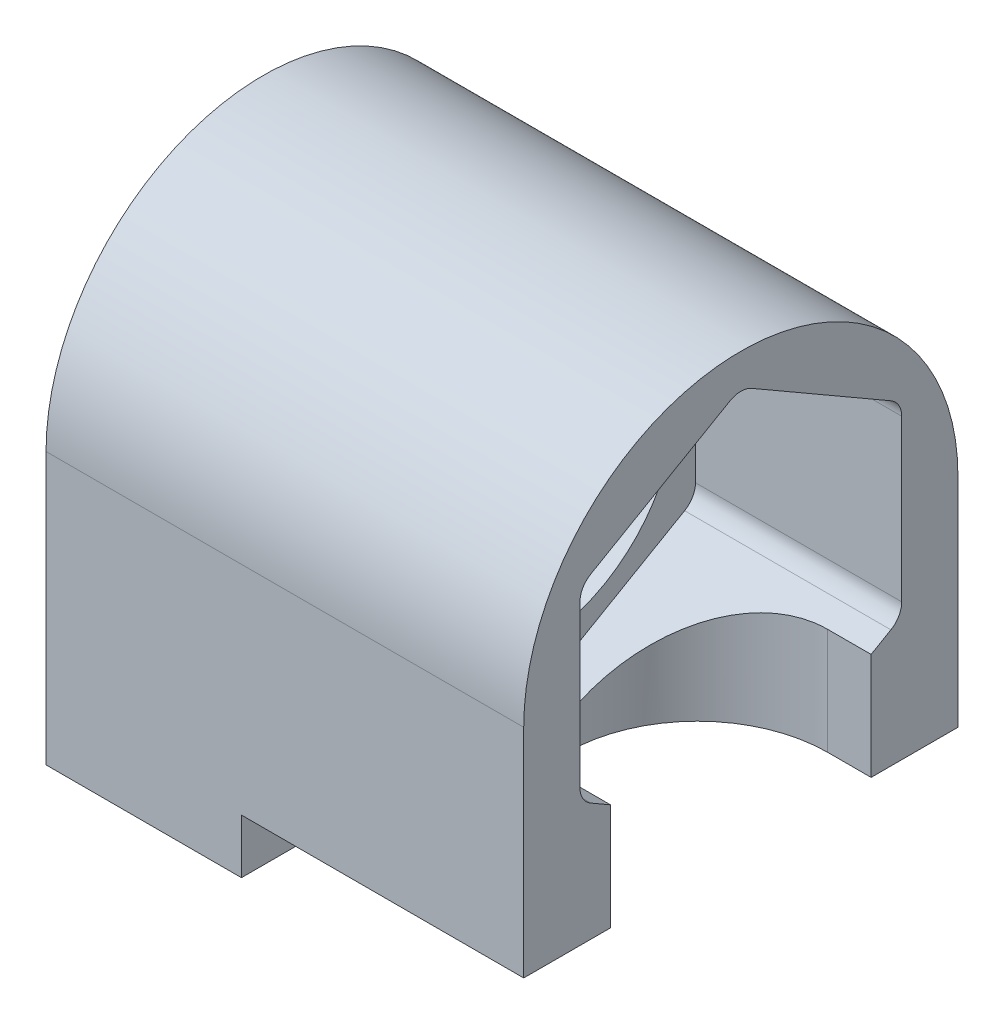
ISO-10303-21;
HEADER;
FILE_DESCRIPTION(('STEP AP214'),'2;1');
FILE_NAME('part.step','',(''),(''),'','','');
FILE_SCHEMA(('AUTOMOTIVE_DESIGN { 1 0 10303 214 1 1 1 1 }'));
ENDSEC;
DATA;
#1=APPLICATION_CONTEXT('core data for automotive mechanical design processes');
#2=APPLICATION_PROTOCOL_DEFINITION('international standard','automotive_design',2000,#1);
#3=PRODUCT_CONTEXT('',#1,'mechanical');
#4=PRODUCT('Part','Part','',(#3));
#5=PRODUCT_RELATED_PRODUCT_CATEGORY('part','',(#4));
#6=PRODUCT_DEFINITION_FORMATION('','',#4);
#7=PRODUCT_DEFINITION_CONTEXT('part definition',#1,'design');
#8=PRODUCT_DEFINITION('design','',#6,#7);
#9=PRODUCT_DEFINITION_SHAPE('','',#8);
#10=(LENGTH_UNIT() NAMED_UNIT(*) SI_UNIT(.MILLI.,.METRE.));
#11=(NAMED_UNIT(*) PLANE_ANGLE_UNIT() SI_UNIT($,.RADIAN.));
#12=(NAMED_UNIT(*) SI_UNIT($,.STERADIAN.) SOLID_ANGLE_UNIT());
#13=UNCERTAINTY_MEASURE_WITH_UNIT(LENGTH_MEASURE(1.E-05),#10,'distance_accuracy_value','');
#14=(GEOMETRIC_REPRESENTATION_CONTEXT(3) GLOBAL_UNCERTAINTY_ASSIGNED_CONTEXT((#13)) GLOBAL_UNIT_ASSIGNED_CONTEXT((#10,
#11,#12)) REPRESENTATION_CONTEXT('',''));
#15=CARTESIAN_POINT('',(0.,0.,0.));
#16=DIRECTION('',(0.,0.,1.));
#17=DIRECTION('',(1.,0.,0.));
#18=AXIS2_PLACEMENT_3D('',#15,#16,#17);
#19=CARTESIAN_POINT('',(22.,0.,0.));
#20=DIRECTION('',(-1.,0.,0.));
#21=DIRECTION('',(0.,0.,1.));
#22=AXIS2_PLACEMENT_3D('',#19,#20,#21);
#23=PLANE('',#22);
#24=DIRECTION('',(0.,0.,1.));
#25=VECTOR('',#24,1.);
#26=CARTESIAN_POINT('',(22.,-10.,10.));
#27=LINE('',#26,#25);
#28=CARTESIAN_POINT('',(22.,-10.,-10.));
#29=VERTEX_POINT('',#28);
#30=CARTESIAN_POINT('',(22.,-10.,-6.));
#31=VERTEX_POINT('',#30);
#32=EDGE_CURVE('E207',#29,#31,#27,.T.);
#33=ORIENTED_EDGE('',*,*,#32,.F.);
#34=DIRECTION('',(0.,1.,0.));
#35=VECTOR('',#34,1.);
#36=CARTESIAN_POINT('',(22.,-12.5,-10.));
#37=LINE('',#36,#35);
#38=CARTESIAN_POINT('',(22.,0.,-10.));
#39=VERTEX_POINT('',#38);
#40=EDGE_CURVE('E204',#29,#39,#37,.T.);
#41=ORIENTED_EDGE('',*,*,#40,.T.);
#42=CARTESIAN_POINT('',(22.,0.,0.));
#43=DIRECTION('',(1.,0.,0.));
#44=DIRECTION('',(0.,0.,1.));
#45=AXIS2_PLACEMENT_3D('',#42,#43,#44);
#46=CIRCLE('',#45,10.);
#47=CARTESIAN_POINT('',(22.,0.,10.));
#48=VERTEX_POINT('',#47);
#49=EDGE_CURVE('E334',#39,#48,#46,.T.);
#50=ORIENTED_EDGE('',*,*,#49,.T.);
#51=DIRECTION('',(0.,-1.,0.));
#52=VECTOR('',#51,1.);
#53=CARTESIAN_POINT('',(22.,0.,10.));
#54=LINE('',#53,#52);
#55=CARTESIAN_POINT('',(22.,-10.,10.));
#56=VERTEX_POINT('',#55);
#57=EDGE_CURVE('E337',#48,#56,#54,.T.);
#58=ORIENTED_EDGE('',*,*,#57,.T.);
#59=CARTESIAN_POINT('',(22.,-10.,6.));
#60=VERTEX_POINT('',#59);
#61=EDGE_CURVE('E205',#60,#56,#27,.T.);
#62=ORIENTED_EDGE('',*,*,#61,.F.);
#63=DIRECTION('',(0.,-1.,0.));
#64=VECTOR('',#63,1.);
#65=CARTESIAN_POINT('',(22.,10.001,6.));
#66=LINE('',#65,#64);
#67=CARTESIAN_POINT('',(22.,-5.09296595124119,6.));
#68=VERTEX_POINT('',#67);
#69=EDGE_CURVE('E367',#68,#60,#66,.T.);
#70=ORIENTED_EDGE('',*,*,#69,.F.);
#71=DIRECTION('',(0.,-0.5,-0.866025403784439));
#72=VECTOR('',#71,1.);
#73=CARTESIAN_POINT('',(22.,-4.56720891778429,6.91063789438405));
#74=LINE('',#73,#72);
#75=CARTESIAN_POINT('',(22.,-4.56720891778429,6.91063789438405));
#76=VERTEX_POINT('',#75);
#77=EDGE_CURVE('E417',#76,#68,#74,.T.);
#78=ORIENTED_EDGE('',*,*,#77,.F.);
#79=CARTESIAN_POINT('',(22.,-3.70118351399985,6.41063789438405));
#80=DIRECTION('',(1.,0.,0.));
#81=DIRECTION('',(0.,0.,-1.));
#82=AXIS2_PLACEMENT_3D('',#79,#80,#81);
#83=CIRCLE('',#82,1.);
#84=CARTESIAN_POINT('',(22.,-3.70118351399984,7.41063789438405));
#85=VERTEX_POINT('',#84);
#86=EDGE_CURVE('E375',#85,#76,#83,.T.);
#87=ORIENTED_EDGE('',*,*,#86,.F.);
#88=DIRECTION('',(0.,-1.,0.));
#89=VECTOR('',#88,1.);
#90=CARTESIAN_POINT('',(22.,3.70118351399985,7.41063789438405));
#91=LINE('',#90,#89);
#92=CARTESIAN_POINT('',(22.,3.70118351399985,7.41063789438405));
#93=VERTEX_POINT('',#92);
#94=EDGE_CURVE('E307',#93,#85,#91,.T.);
#95=ORIENTED_EDGE('',*,*,#94,.F.);
#96=CARTESIAN_POINT('',(22.,3.70118351399985,6.41063789438405));
#97=DIRECTION('',(1.,0.,0.));
#98=DIRECTION('',(0.,0.,-1.));
#99=AXIS2_PLACEMENT_3D('',#96,#97,#98);
#100=CIRCLE('',#99,1.);
#101=CARTESIAN_POINT('',(22.,4.56720891778429,6.91063789438405));
#102=VERTEX_POINT('',#101);
#103=EDGE_CURVE('E439',#102,#93,#100,.T.);
#104=ORIENTED_EDGE('',*,*,#103,.F.);
#105=DIRECTION('',(0.,-0.5,0.866025403784439));
#106=VECTOR('',#105,1.);
#107=CARTESIAN_POINT('',(22.,8.26839243178414,0.500000000000005));
#108=LINE('',#107,#106);
#109=CARTESIAN_POINT('',(22.,8.26839243178414,0.500000000000005));
#110=VERTEX_POINT('',#109);
#111=EDGE_CURVE('E437',#110,#102,#108,.T.);
#112=ORIENTED_EDGE('',*,*,#111,.F.);
#113=CARTESIAN_POINT('',(22.,7.4023670279997,0.));
#114=DIRECTION('',(1.,0.,0.));
#115=DIRECTION('',(0.,0.,-1.));
#116=AXIS2_PLACEMENT_3D('',#113,#114,#115);
#117=CIRCLE('',#116,1.);
#118=CARTESIAN_POINT('',(22.,8.26839243178414,-0.500000000000003));
#119=VERTEX_POINT('',#118);
#120=EDGE_CURVE('E434',#119,#110,#117,.T.);
#121=ORIENTED_EDGE('',*,*,#120,.F.);
#122=DIRECTION('',(0.,0.5,0.866025403784439));
#123=VECTOR('',#122,1.);
#124=CARTESIAN_POINT('',(22.,4.56720891778429,-6.91063789438405));
#125=LINE('',#124,#123);
#126=CARTESIAN_POINT('',(22.,4.56720891778429,-6.91063789438405));
#127=VERTEX_POINT('',#126);
#128=EDGE_CURVE('E431',#127,#119,#125,.T.);
#129=ORIENTED_EDGE('',*,*,#128,.F.);
#130=CARTESIAN_POINT('',(22.,3.70118351399985,-6.41063789438405));
#131=DIRECTION('',(1.,0.,0.));
#132=DIRECTION('',(0.,0.,-1.));
#133=AXIS2_PLACEMENT_3D('',#130,#131,#132);
#134=CIRCLE('',#133,1.);
#135=CARTESIAN_POINT('',(22.,3.70118351399985,-7.41063789438405));
#136=VERTEX_POINT('',#135);
#137=EDGE_CURVE('E428',#136,#127,#134,.T.);
#138=ORIENTED_EDGE('',*,*,#137,.F.);
#139=DIRECTION('',(0.,1.,0.));
#140=VECTOR('',#139,1.);
#141=CARTESIAN_POINT('',(22.,-3.70118351399985,-7.41063789438405));
#142=LINE('',#141,#140);
#143=CARTESIAN_POINT('',(22.,-3.70118351399985,-7.41063789438405));
#144=VERTEX_POINT('',#143);
#145=EDGE_CURVE('E425',#144,#136,#142,.T.);
#146=ORIENTED_EDGE('',*,*,#145,.F.);
#147=CARTESIAN_POINT('',(22.,-3.70118351399985,-6.41063789438405));
#148=DIRECTION('',(1.,0.,0.));
#149=DIRECTION('',(0.,0.,1.));
#150=AXIS2_PLACEMENT_3D('',#147,#148,#149);
#151=CIRCLE('',#150,1.);
#152=CARTESIAN_POINT('',(22.,-4.56720891778429,-6.91063789438405));
#153=VERTEX_POINT('',#152);
#154=EDGE_CURVE('E422',#153,#144,#151,.T.);
#155=ORIENTED_EDGE('',*,*,#154,.F.);
#156=DIRECTION('',(0.,0.5,-0.866025403784438));
#157=VECTOR('',#156,1.);
#158=CARTESIAN_POINT('',(22.,-8.26839243178414,-0.500000000000009));
#159=LINE('',#158,#157);
#160=CARTESIAN_POINT('',(22.,-5.09296595124119,-6.));
#161=VERTEX_POINT('',#160);
#162=EDGE_CURVE('E420',#161,#153,#159,.T.);
#163=ORIENTED_EDGE('',*,*,#162,.F.);
#164=DIRECTION('',(0.,-1.,0.));
#165=VECTOR('',#164,1.);
#166=CARTESIAN_POINT('',(22.,10.001,-6.));
#167=LINE('',#166,#165);
#168=EDGE_CURVE('E229',#161,#31,#167,.T.);
#169=ORIENTED_EDGE('',*,*,#168,.T.);
#170=EDGE_LOOP('',(#33,#41,#50,#58,#62,#70,#78,#87,#95,#104,#112,#121,#129,#138,#146,#155,#163,#169));
#171=FACE_BOUND('',#170,.T.);
#172=ADVANCED_FACE('F34',(#171),#23,.F.);
#173=CARTESIAN_POINT('',(22.,10.001,-6.));
#174=DIRECTION('',(0.,0.,-1.));
#175=DIRECTION('',(-1.,0.,0.));
#176=AXIS2_PLACEMENT_3D('',#173,#174,#175);
#177=PLANE('',#176);
#178=DIRECTION('',(-1.,0.,0.));
#179=VECTOR('',#178,1.);
#180=CARTESIAN_POINT('',(22.,-10.,-6.));
#181=LINE('',#180,#179);
#182=CARTESIAN_POINT('',(20.,-9.99999999999999,-6.));
#183=VERTEX_POINT('',#182);
#184=EDGE_CURVE('E48',#31,#183,#181,.T.);
#185=ORIENTED_EDGE('',*,*,#184,.F.);
#186=ORIENTED_EDGE('',*,*,#168,.F.);
#187=DIRECTION('',(-1.,0.,0.));
#188=VECTOR('',#187,1.);
#189=CARTESIAN_POINT('',(22.,-5.09296595124119,-6.));
#190=LINE('',#189,#188);
#191=CARTESIAN_POINT('',(20.,-5.09296595124119,-6.));
#192=VERTEX_POINT('',#191);
#193=EDGE_CURVE('E217',#161,#192,#190,.T.);
#194=ORIENTED_EDGE('',*,*,#193,.T.);
#195=DIRECTION('',(0.,-1.,0.));
#196=VECTOR('',#195,1.);
#197=CARTESIAN_POINT('',(20.,10.001,-6.));
#198=LINE('',#197,#196);
#199=EDGE_CURVE('E358',#192,#183,#198,.T.);
#200=ORIENTED_EDGE('',*,*,#199,.T.);
#201=EDGE_LOOP('',(#185,#186,#194,#200));
#202=FACE_BOUND('',#201,.T.);
#203=ADVANCED_FACE('F247',(#202),#177,.F.);
#204=CARTESIAN_POINT('',(20.,10.001,6.));
#205=DIRECTION('',(0.,0.,1.));
#206=DIRECTION('',(1.,0.,0.));
#207=AXIS2_PLACEMENT_3D('',#204,#205,#206);
#208=PLANE('',#207);
#209=DIRECTION('',(1.,0.,0.));
#210=VECTOR('',#209,1.);
#211=CARTESIAN_POINT('',(20.,-10.,6.));
#212=LINE('',#211,#210);
#213=CARTESIAN_POINT('',(20.,-10.,6.));
#214=VERTEX_POINT('',#213);
#215=EDGE_CURVE('E212',#214,#60,#212,.T.);
#216=ORIENTED_EDGE('',*,*,#215,.F.);
#217=DIRECTION('',(0.,-1.,0.));
#218=VECTOR('',#217,1.);
#219=CARTESIAN_POINT('',(20.,10.001,6.));
#220=LINE('',#219,#218);
#221=CARTESIAN_POINT('',(20.,-5.09296595124119,6.));
#222=VERTEX_POINT('',#221);
#223=EDGE_CURVE('E361',#222,#214,#220,.T.);
#224=ORIENTED_EDGE('',*,*,#223,.F.);
#225=DIRECTION('',(1.,0.,0.));
#226=VECTOR('',#225,1.);
#227=CARTESIAN_POINT('',(20.,-5.09296595124119,6.));
#228=LINE('',#227,#226);
#229=EDGE_CURVE('E221',#222,#68,#228,.T.);
#230=ORIENTED_EDGE('',*,*,#229,.T.);
#231=ORIENTED_EDGE('',*,*,#69,.T.);
#232=EDGE_LOOP('',(#216,#224,#230,#231));
#233=FACE_BOUND('',#232,.T.);
#234=ADVANCED_FACE('F253',(#233),#208,.F.);
#235=CARTESIAN_POINT('',(20.,10.001,0.));
#236=DIRECTION('',(0.,-1.,0.));
#237=DIRECTION('',(0.,0.,-1.));
#238=AXIS2_PLACEMENT_3D('',#235,#236,#237);
#239=CYLINDRICAL_SURFACE('',#238,6.);
#240=CARTESIAN_POINT('',(20.,-10.,0.));
#241=DIRECTION('',(0.,-1.,0.));
#242=DIRECTION('',(0.,0.,-1.));
#243=AXIS2_PLACEMENT_3D('',#240,#241,#242);
#244=CIRCLE('',#243,6.);
#245=EDGE_CURVE('E11',#183,#214,#244,.F.);
#246=ORIENTED_EDGE('',*,*,#245,.F.);
#247=ORIENTED_EDGE('',*,*,#199,.F.);
#248=CARTESIAN_POINT('',(20.,-8.55706756637895,0.));
#249=DIRECTION('',(0.,-0.866025403784439,-0.5));
#250=DIRECTION('',(0.,-0.5,0.866025403784439));
#251=AXIS2_PLACEMENT_3D('',#248,#249,#250);
#252=ELLIPSE('',#251,6.92820323027551,6.);
#253=CARTESIAN_POINT('',(14.0208696284493,-8.26839243178414,-0.500000000000009));
#254=VERTEX_POINT('',#253);
#255=EDGE_CURVE('E220',#192,#254,#252,.F.);
#256=ORIENTED_EDGE('',*,*,#255,.T.);
#257=CARTESIAN_POINT('',(14.0208696284493,-8.26839243178414,-0.500000000000009));
#258=CARTESIAN_POINT('',(14.0188521825808,-8.28231718289016,-0.475880957474097));
#259=CARTESIAN_POINT('',(14.0169346969243,-8.29523149292469,-0.451184964933938));
#260=CARTESIAN_POINT('',(14.0133475272348,-8.31896204949919,-0.400787080981888));
#261=CARTESIAN_POINT('',(14.0116778473985,-8.32977826050909,-0.375085172544272));
#262=CARTESIAN_POINT('',(14.0071179952394,-8.35892779500484,-0.296789237392052));
#263=CARTESIAN_POINT('',(14.0046692970077,-8.37401340765047,-0.242915856640522));
#264=CARTESIAN_POINT('',(14.0012312142338,-8.39500742661461,-0.133351947150136));
#265=CARTESIAN_POINT('',(14.0002428411104,-8.40090947256024,-0.0776601862650767));
#266=CARTESIAN_POINT('',(13.9998367320083,-8.40334708936088,0.0339595343816274));
#267=CARTESIAN_POINT('',(14.0004194455048,-8.39987997977511,0.0898875571657821));
#268=CARTESIAN_POINT('',(14.0030839236658,-8.38372532768659,0.200058324917833));
#269=CARTESIAN_POINT('',(14.0051581549396,-8.3710841189644,0.254308115693947));
#270=CARTESIAN_POINT('',(14.0105671904883,-8.33702562225325,0.359826263977945));
#271=CARTESIAN_POINT('',(14.0138994586155,-8.31562598362689,0.411100381958611));
#272=CARTESIAN_POINT('',(14.0187065810832,-8.28322783966206,0.473620291295192));
#273=CARTESIAN_POINT('',(14.0197734991748,-8.27595776424847,0.4869005967692));
#274=CARTESIAN_POINT('',(14.0208696284493,-8.26839243178414,0.5));
#275=B_SPLINE_CURVE_WITH_KNOTS('',3,(#257,#258,#259,#260,#261,#262,#263,#264,#265,#266,#267,
#268,#269,#270,#271,#272,#273,#274),.UNSPECIFIED.,.F.,.F.,(4,2,2,2,2,2,2,2,4),(0.,
0.0837190005730716,0.167439418753399,0.334574610497153,0.50182550562267,0.669124254962629,
0.835583890612964,1.00170972744011,1.04722485743825),.UNSPECIFIED.);
#276=CARTESIAN_POINT('',(14.0208696284493,-8.26839243178414,0.5));
#277=VERTEX_POINT('',#276);
#278=EDGE_CURVE('E56',#254,#277,#275,.T.);
#279=ORIENTED_EDGE('',*,*,#278,.T.);
#280=CARTESIAN_POINT('',(20.,-8.55706756637895,0.));
#281=DIRECTION('',(0.,-0.866025403784439,0.5));
#282=DIRECTION('',(0.,-0.5,-0.866025403784439));
#283=AXIS2_PLACEMENT_3D('',#280,#281,#282);
#284=ELLIPSE('',#283,6.92820323027551,6.);
#285=EDGE_CURVE('E216',#277,#222,#284,.F.);
#286=ORIENTED_EDGE('',*,*,#285,.T.);
#287=ORIENTED_EDGE('',*,*,#223,.T.);
#288=EDGE_LOOP('',(#246,#247,#256,#279,#286,#287));
#289=FACE_BOUND('',#288,.T.);
#290=ADVANCED_FACE('F231',(#289),#239,.F.);
#291=CARTESIAN_POINT('',(22.,0.,0.));
#292=DIRECTION('',(-1.,0.,0.));
#293=DIRECTION('',(0.,0.,1.));
#294=AXIS2_PLACEMENT_3D('',#291,#292,#293);
#295=CYLINDRICAL_SURFACE('',#294,6.5);
#296=CARTESIAN_POINT('',(0.,0.,0.));
#297=DIRECTION('',(1.,0.,0.));
#298=DIRECTION('',(0.,0.,-1.));
#299=AXIS2_PLACEMENT_3D('',#296,#297,#298);
#300=CIRCLE('',#299,6.5);
#301=CARTESIAN_POINT('',(0.,0.,-6.5));
#302=VERTEX_POINT('',#301);
#303=EDGE_CURVE('E292',#302,#302,#300,.T.);
#304=ORIENTED_EDGE('',*,*,#303,.F.);
#305=EDGE_LOOP('',(#304));
#306=FACE_BOUND('',#305,.T.);
#307=CARTESIAN_POINT('',(12.5,0.,0.));
#308=DIRECTION('',(1.,0.,0.));
#309=DIRECTION('',(0.,0.,-1.));
#310=AXIS2_PLACEMENT_3D('',#307,#308,#309);
#311=CIRCLE('',#310,6.5);
#312=CARTESIAN_POINT('',(12.5,0.,-6.5));
#313=VERTEX_POINT('',#312);
#314=EDGE_CURVE('E290',#313,#313,#311,.T.);
#315=ORIENTED_EDGE('',*,*,#314,.T.);
#316=EDGE_LOOP('',(#315));
#317=FACE_BOUND('',#316,.T.);
#318=ADVANCED_FACE('F258',(#306,#317),#295,.F.);
#319=CARTESIAN_POINT('',(0.,0.,0.));
#320=DIRECTION('',(-1.,0.,0.));
#321=DIRECTION('',(0.,0.,1.));
#322=AXIS2_PLACEMENT_3D('',#319,#320,#321);
#323=PLANE('',#322);
#324=CARTESIAN_POINT('',(0.,0.,0.));
#325=DIRECTION('',(1.,0.,0.));
#326=DIRECTION('',(0.,0.,1.));
#327=AXIS2_PLACEMENT_3D('',#324,#325,#326);
#328=CIRCLE('',#327,10.);
#329=CARTESIAN_POINT('',(0.,0.,-10.));
#330=VERTEX_POINT('',#329);
#331=CARTESIAN_POINT('',(0.,0.,10.));
#332=VERTEX_POINT('',#331);
#333=EDGE_CURVE('E297',#330,#332,#328,.T.);
#334=ORIENTED_EDGE('',*,*,#333,.F.);
#335=DIRECTION('',(0.,1.,0.));
#336=VECTOR('',#335,1.);
#337=CARTESIAN_POINT('',(0.,-12.5,-10.));
#338=LINE('',#337,#336);
#339=CARTESIAN_POINT('',(0.,-12.5,-10.));
#340=VERTEX_POINT('',#339);
#341=EDGE_CURVE('E338',#340,#330,#338,.T.);
#342=ORIENTED_EDGE('',*,*,#341,.F.);
#343=DIRECTION('',(0.,0.,-1.));
#344=VECTOR('',#343,1.);
#345=CARTESIAN_POINT('',(0.,-12.5,10.));
#346=LINE('',#345,#344);
#347=CARTESIAN_POINT('',(0.,-12.5,10.));
#348=VERTEX_POINT('',#347);
#349=EDGE_CURVE('E345',#348,#340,#346,.T.);
#350=ORIENTED_EDGE('',*,*,#349,.F.);
#351=DIRECTION('',(0.,-1.,0.));
#352=VECTOR('',#351,1.);
#353=CARTESIAN_POINT('',(0.,0.,10.));
#354=LINE('',#353,#352);
#355=EDGE_CURVE('E281',#332,#348,#354,.T.);
#356=ORIENTED_EDGE('',*,*,#355,.F.);
#357=EDGE_LOOP('',(#334,#342,#350,#356));
#358=FACE_BOUND('',#357,.T.);
#359=ORIENTED_EDGE('',*,*,#303,.T.);
#360=EDGE_LOOP('',(#359));
#361=FACE_BOUND('',#360,.T.);
#362=ADVANCED_FACE('F260',(#358,#361),#323,.T.);
#363=CARTESIAN_POINT('',(22.,0.,0.));
#364=DIRECTION('',(-1.,0.,0.));
#365=DIRECTION('',(0.,0.,1.));
#366=AXIS2_PLACEMENT_3D('',#363,#364,#365);
#367=CYLINDRICAL_SURFACE('',#366,10.);
#368=ORIENTED_EDGE('',*,*,#333,.T.);
#369=DIRECTION('',(-1.,0.,0.));
#370=VECTOR('',#369,1.);
#371=CARTESIAN_POINT('',(22.,0.,10.));
#372=LINE('',#371,#370);
#373=EDGE_CURVE('E42',#48,#332,#372,.T.);
#374=ORIENTED_EDGE('',*,*,#373,.F.);
#375=ORIENTED_EDGE('',*,*,#49,.F.);
#376=DIRECTION('',(-1.,0.,0.));
#377=VECTOR('',#376,1.);
#378=CARTESIAN_POINT('',(22.,0.,-10.));
#379=LINE('',#378,#377);
#380=EDGE_CURVE('E287',#39,#330,#379,.T.);
#381=ORIENTED_EDGE('',*,*,#380,.T.);
#382=EDGE_LOOP('',(#368,#374,#375,#381));
#383=FACE_BOUND('',#382,.T.);
#384=ADVANCED_FACE('F36',(#383),#367,.T.);
#385=CARTESIAN_POINT('',(22.,0.,10.));
#386=DIRECTION('',(0.,0.,-1.));
#387=DIRECTION('',(0.,1.,0.));
#388=AXIS2_PLACEMENT_3D('',#385,#386,#387);
#389=PLANE('',#388);
#390=DIRECTION('',(-1.,0.,0.));
#391=VECTOR('',#390,1.);
#392=CARTESIAN_POINT('',(22.,-12.5,10.));
#393=LINE('',#392,#391);
#394=CARTESIAN_POINT('',(9.,-12.5,10.));
#395=VERTEX_POINT('',#394);
#396=EDGE_CURVE('E279',#395,#348,#393,.T.);
#397=ORIENTED_EDGE('',*,*,#396,.F.);
#398=DIRECTION('',(0.,-1.,0.));
#399=VECTOR('',#398,1.);
#400=CARTESIAN_POINT('',(9.,-10.,10.));
#401=LINE('',#400,#399);
#402=CARTESIAN_POINT('',(9.,-10.,10.));
#403=VERTEX_POINT('',#402);
#404=EDGE_CURVE('E192',#403,#395,#401,.T.);
#405=ORIENTED_EDGE('',*,*,#404,.F.);
#406=DIRECTION('',(-1.,0.,0.));
#407=VECTOR('',#406,1.);
#408=CARTESIAN_POINT('',(9.,-10.,10.));
#409=LINE('',#408,#407);
#410=EDGE_CURVE('E193',#56,#403,#409,.T.);
#411=ORIENTED_EDGE('',*,*,#410,.F.);
#412=ORIENTED_EDGE('',*,*,#57,.F.);
#413=ORIENTED_EDGE('',*,*,#373,.T.);
#414=ORIENTED_EDGE('',*,*,#355,.T.);
#415=EDGE_LOOP('',(#397,#405,#411,#412,#413,#414));
#416=FACE_BOUND('',#415,.T.);
#417=ADVANCED_FACE('F269',(#416),#389,.F.);
#418=CARTESIAN_POINT('',(22.,-12.5,10.));
#419=DIRECTION('',(0.,1.,0.));
#420=DIRECTION('',(0.,0.,1.));
#421=AXIS2_PLACEMENT_3D('',#418,#419,#420);
#422=PLANE('',#421);
#423=DIRECTION('',(-1.,0.,0.));
#424=VECTOR('',#423,1.);
#425=CARTESIAN_POINT('',(22.,-12.5,-10.));
#426=LINE('',#425,#424);
#427=CARTESIAN_POINT('',(9.,-12.5,-10.));
#428=VERTEX_POINT('',#427);
#429=EDGE_CURVE('E284',#428,#340,#426,.T.);
#430=ORIENTED_EDGE('',*,*,#429,.F.);
#431=DIRECTION('',(0.,0.,-1.));
#432=VECTOR('',#431,1.);
#433=CARTESIAN_POINT('',(9.,-12.5,10.));
#434=LINE('',#433,#432);
#435=EDGE_CURVE('E188',#395,#428,#434,.T.);
#436=ORIENTED_EDGE('',*,*,#435,.F.);
#437=ORIENTED_EDGE('',*,*,#396,.T.);
#438=ORIENTED_EDGE('',*,*,#349,.T.);
#439=EDGE_LOOP('',(#430,#436,#437,#438));
#440=FACE_BOUND('',#439,.T.);
#441=CARTESIAN_POINT('',(5.,-12.5,5.));
#442=DIRECTION('',(0.,-1.,0.));
#443=DIRECTION('',(0.,0.,-1.));
#444=AXIS2_PLACEMENT_3D('',#441,#442,#443);
#445=CIRCLE('',#444,2.75);
#446=CARTESIAN_POINT('',(5.,-12.5,2.25));
#447=VERTEX_POINT('',#446);
#448=EDGE_CURVE('E376',#447,#447,#445,.T.);
#449=ORIENTED_EDGE('',*,*,#448,.F.);
#450=EDGE_LOOP('',(#449));
#451=FACE_BOUND('',#450,.T.);
#452=CARTESIAN_POINT('',(5.,-12.5,-5.));
#453=DIRECTION('',(0.,-1.,0.));
#454=DIRECTION('',(0.,0.,-1.));
#455=AXIS2_PLACEMENT_3D('',#452,#453,#454);
#456=CIRCLE('',#455,2.75);
#457=CARTESIAN_POINT('',(5.,-12.5,-7.75));
#458=VERTEX_POINT('',#457);
#459=EDGE_CURVE('E360',#458,#458,#456,.T.);
#460=ORIENTED_EDGE('',*,*,#459,.F.);
#461=EDGE_LOOP('',(#460));
#462=FACE_BOUND('',#461,.T.);
#463=ADVANCED_FACE('F267',(#440,#451,#462),#422,.F.);
#464=CARTESIAN_POINT('',(22.,-12.5,-10.));
#465=DIRECTION('',(0.,0.,1.));
#466=DIRECTION('',(1.,0.,0.));
#467=AXIS2_PLACEMENT_3D('',#464,#465,#466);
#468=PLANE('',#467);
#469=DIRECTION('',(1.,0.,0.));
#470=VECTOR('',#469,1.);
#471=CARTESIAN_POINT('',(9.,-10.,-10.));
#472=LINE('',#471,#470);
#473=CARTESIAN_POINT('',(9.,-10.,-10.));
#474=VERTEX_POINT('',#473);
#475=EDGE_CURVE('E196',#474,#29,#472,.T.);
#476=ORIENTED_EDGE('',*,*,#475,.F.);
#477=DIRECTION('',(0.,-1.,0.));
#478=VECTOR('',#477,1.);
#479=CARTESIAN_POINT('',(9.,-10.,-10.));
#480=LINE('',#479,#478);
#481=EDGE_CURVE('E182',#474,#428,#480,.T.);
#482=ORIENTED_EDGE('',*,*,#481,.T.);
#483=ORIENTED_EDGE('',*,*,#429,.T.);
#484=ORIENTED_EDGE('',*,*,#341,.T.);
#485=ORIENTED_EDGE('',*,*,#380,.F.);
#486=ORIENTED_EDGE('',*,*,#40,.F.);
#487=EDGE_LOOP('',(#476,#482,#483,#484,#485,#486));
#488=FACE_BOUND('',#487,.T.);
#489=ADVANCED_FACE('F202',(#488),#468,.F.);
#490=CARTESIAN_POINT('',(12.5,-3.70118351399985,6.41063789438405));
#491=DIRECTION('',(1.,0.,0.));
#492=DIRECTION('',(0.,0.,-1.));
#493=AXIS2_PLACEMENT_3D('',#490,#491,#492);
#494=CYLINDRICAL_SURFACE('',#493,1.);
#495=ORIENTED_EDGE('',*,*,#86,.T.);
#496=DIRECTION('',(1.,0.,0.));
#497=VECTOR('',#496,1.);
#498=CARTESIAN_POINT('',(12.5,-4.56720891778429,6.91063789438405));
#499=LINE('',#498,#497);
#500=CARTESIAN_POINT('',(12.5,-4.56720891778429,6.91063789438405));
#501=VERTEX_POINT('',#500);
#502=EDGE_CURVE('E330',#501,#76,#499,.T.);
#503=ORIENTED_EDGE('',*,*,#502,.F.);
#504=CARTESIAN_POINT('',(12.5,-3.70118351399985,6.41063789438405));
#505=DIRECTION('',(1.,0.,0.));
#506=DIRECTION('',(0.,0.,-1.));
#507=AXIS2_PLACEMENT_3D('',#504,#505,#506);
#508=CIRCLE('',#507,1.);
#509=CARTESIAN_POINT('',(12.5,-3.70118351399984,7.41063789438405));
#510=VERTEX_POINT('',#509);
#511=EDGE_CURVE('E381',#510,#501,#508,.T.);
#512=ORIENTED_EDGE('',*,*,#511,.F.);
#513=DIRECTION('',(1.,0.,0.));
#514=VECTOR('',#513,1.);
#515=CARTESIAN_POINT('',(12.5,-3.70118351399984,7.41063789438405));
#516=LINE('',#515,#514);
#517=EDGE_CURVE('E293',#510,#85,#516,.T.);
#518=ORIENTED_EDGE('',*,*,#517,.T.);
#519=EDGE_LOOP('',(#495,#503,#512,#518));
#520=FACE_BOUND('',#519,.T.);
#521=ADVANCED_FACE('F266',(#520),#494,.F.);
#522=CARTESIAN_POINT('',(12.5,3.70118351399985,7.41063789438405));
#523=DIRECTION('',(0.,0.,1.));
#524=DIRECTION('',(0.,-1.,0.));
#525=AXIS2_PLACEMENT_3D('',#522,#523,#524);
#526=PLANE('',#525);
#527=ORIENTED_EDGE('',*,*,#94,.T.);
#528=ORIENTED_EDGE('',*,*,#517,.F.);
#529=DIRECTION('',(0.,-1.,0.));
#530=VECTOR('',#529,1.);
#531=CARTESIAN_POINT('',(12.5,3.70118351399985,7.41063789438405));
#532=LINE('',#531,#530);
#533=CARTESIAN_POINT('',(12.5,3.70118351399985,7.41063789438405));
#534=VERTEX_POINT('',#533);
#535=EDGE_CURVE('E332',#534,#510,#532,.T.);
#536=ORIENTED_EDGE('',*,*,#535,.F.);
#537=DIRECTION('',(1.,0.,0.));
#538=VECTOR('',#537,1.);
#539=CARTESIAN_POINT('',(12.5,3.70118351399985,7.41063789438405));
#540=LINE('',#539,#538);
#541=EDGE_CURVE('E299',#534,#93,#540,.T.);
#542=ORIENTED_EDGE('',*,*,#541,.T.);
#543=EDGE_LOOP('',(#527,#528,#536,#542));
#544=FACE_BOUND('',#543,.T.);
#545=ADVANCED_FACE('F446',(#544),#526,.F.);
#546=CARTESIAN_POINT('',(12.5,3.70118351399985,6.41063789438405));
#547=DIRECTION('',(1.,0.,0.));
#548=DIRECTION('',(0.,0.,-1.));
#549=AXIS2_PLACEMENT_3D('',#546,#547,#548);
#550=CYLINDRICAL_SURFACE('',#549,1.);
#551=ORIENTED_EDGE('',*,*,#103,.T.);
#552=ORIENTED_EDGE('',*,*,#541,.F.);
#553=CARTESIAN_POINT('',(12.5,3.70118351399985,6.41063789438405));
#554=DIRECTION('',(1.,0.,0.));
#555=DIRECTION('',(0.,0.,-1.));
#556=AXIS2_PLACEMENT_3D('',#553,#554,#555);
#557=CIRCLE('',#556,1.);
#558=CARTESIAN_POINT('',(12.5,4.56720891778429,6.91063789438405));
#559=VERTEX_POINT('',#558);
#560=EDGE_CURVE('E411',#559,#534,#557,.T.);
#561=ORIENTED_EDGE('',*,*,#560,.F.);
#562=DIRECTION('',(1.,0.,0.));
#563=VECTOR('',#562,1.);
#564=CARTESIAN_POINT('',(12.5,4.56720891778429,6.91063789438405));
#565=LINE('',#564,#563);
#566=EDGE_CURVE('E304',#559,#102,#565,.T.);
#567=ORIENTED_EDGE('',*,*,#566,.T.);
#568=EDGE_LOOP('',(#551,#552,#561,#567));
#569=FACE_BOUND('',#568,.T.);
#570=ADVANCED_FACE('F459',(#569),#550,.F.);
#571=CARTESIAN_POINT('',(12.5,8.26839243178414,0.500000000000005));
#572=DIRECTION('',(0.,0.866025403784439,0.5));
#573=DIRECTION('',(0.,-0.5,0.866025403784439));
#574=AXIS2_PLACEMENT_3D('',#571,#572,#573);
#575=PLANE('',#574);
#576=ORIENTED_EDGE('',*,*,#111,.T.);
#577=ORIENTED_EDGE('',*,*,#566,.F.);
#578=DIRECTION('',(0.,-0.5,0.866025403784439));
#579=VECTOR('',#578,1.);
#580=CARTESIAN_POINT('',(12.5,8.26839243178414,0.500000000000005));
#581=LINE('',#580,#579);
#582=CARTESIAN_POINT('',(12.5,8.26839243178414,0.500000000000005));
#583=VERTEX_POINT('',#582);
#584=EDGE_CURVE('E408',#583,#559,#581,.T.);
#585=ORIENTED_EDGE('',*,*,#584,.F.);
#586=DIRECTION('',(1.,0.,0.));
#587=VECTOR('',#586,1.);
#588=CARTESIAN_POINT('',(12.5,8.26839243178414,0.500000000000005));
#589=LINE('',#588,#587);
#590=EDGE_CURVE('E311',#583,#110,#589,.T.);
#591=ORIENTED_EDGE('',*,*,#590,.T.);
#592=EDGE_LOOP('',(#576,#577,#585,#591));
#593=FACE_BOUND('',#592,.T.);
#594=ADVANCED_FACE('F462',(#593),#575,.F.);
#595=CARTESIAN_POINT('',(12.5,7.4023670279997,0.));
#596=DIRECTION('',(1.,0.,0.));
#597=DIRECTION('',(0.,0.,-1.));
#598=AXIS2_PLACEMENT_3D('',#595,#596,#597);
#599=CYLINDRICAL_SURFACE('',#598,1.);
#600=ORIENTED_EDGE('',*,*,#120,.T.);
#601=ORIENTED_EDGE('',*,*,#590,.F.);
#602=CARTESIAN_POINT('',(12.5,7.4023670279997,0.));
#603=DIRECTION('',(1.,0.,0.));
#604=DIRECTION('',(0.,0.,-1.));
#605=AXIS2_PLACEMENT_3D('',#602,#603,#604);
#606=CIRCLE('',#605,1.);
#607=CARTESIAN_POINT('',(12.5,8.26839243178414,-0.500000000000003));
#608=VERTEX_POINT('',#607);
#609=EDGE_CURVE('E405',#608,#583,#606,.T.);
#610=ORIENTED_EDGE('',*,*,#609,.F.);
#611=DIRECTION('',(1.,0.,0.));
#612=VECTOR('',#611,1.);
#613=CARTESIAN_POINT('',(12.5,8.26839243178414,-0.500000000000003));
#614=LINE('',#613,#612);
#615=EDGE_CURVE('E313',#608,#119,#614,.T.);
#616=ORIENTED_EDGE('',*,*,#615,.T.);
#617=EDGE_LOOP('',(#600,#601,#610,#616));
#618=FACE_BOUND('',#617,.T.);
#619=ADVANCED_FACE('F467',(#618),#599,.F.);
#620=CARTESIAN_POINT('',(12.5,4.56720891778429,-6.91063789438405));
#621=DIRECTION('',(0.,0.866025403784439,-0.5));
#622=DIRECTION('',(0.,0.5,0.866025403784439));
#623=AXIS2_PLACEMENT_3D('',#620,#621,#622);
#624=PLANE('',#623);
#625=ORIENTED_EDGE('',*,*,#128,.T.);
#626=ORIENTED_EDGE('',*,*,#615,.F.);
#627=DIRECTION('',(0.,0.5,0.866025403784439));
#628=VECTOR('',#627,1.);
#629=CARTESIAN_POINT('',(12.5,4.56720891778429,-6.91063789438405));
#630=LINE('',#629,#628);
#631=CARTESIAN_POINT('',(12.5,4.56720891778429,-6.91063789438405));
#632=VERTEX_POINT('',#631);
#633=EDGE_CURVE('E402',#632,#608,#630,.T.);
#634=ORIENTED_EDGE('',*,*,#633,.F.);
#635=DIRECTION('',(1.,0.,0.));
#636=VECTOR('',#635,1.);
#637=CARTESIAN_POINT('',(12.5,4.56720891778429,-6.91063789438405));
#638=LINE('',#637,#636);
#639=EDGE_CURVE('E315',#632,#127,#638,.T.);
#640=ORIENTED_EDGE('',*,*,#639,.T.);
#641=EDGE_LOOP('',(#625,#626,#634,#640));
#642=FACE_BOUND('',#641,.T.);
#643=ADVANCED_FACE('F471',(#642),#624,.F.);
#644=CARTESIAN_POINT('',(12.5,3.70118351399985,-6.41063789438405));
#645=DIRECTION('',(1.,0.,0.));
#646=DIRECTION('',(0.,0.,-1.));
#647=AXIS2_PLACEMENT_3D('',#644,#645,#646);
#648=CYLINDRICAL_SURFACE('',#647,1.);
#649=ORIENTED_EDGE('',*,*,#137,.T.);
#650=ORIENTED_EDGE('',*,*,#639,.F.);
#651=CARTESIAN_POINT('',(12.5,3.70118351399985,-6.41063789438405));
#652=DIRECTION('',(1.,0.,0.));
#653=DIRECTION('',(0.,0.,-1.));
#654=AXIS2_PLACEMENT_3D('',#651,#652,#653);
#655=CIRCLE('',#654,1.);
#656=CARTESIAN_POINT('',(12.5,3.70118351399985,-7.41063789438405));
#657=VERTEX_POINT('',#656);
#658=EDGE_CURVE('E399',#657,#632,#655,.T.);
#659=ORIENTED_EDGE('',*,*,#658,.F.);
#660=DIRECTION('',(1.,0.,0.));
#661=VECTOR('',#660,1.);
#662=CARTESIAN_POINT('',(12.5,3.70118351399985,-7.41063789438405));
#663=LINE('',#662,#661);
#664=EDGE_CURVE('E317',#657,#136,#663,.T.);
#665=ORIENTED_EDGE('',*,*,#664,.T.);
#666=EDGE_LOOP('',(#649,#650,#659,#665));
#667=FACE_BOUND('',#666,.T.);
#668=ADVANCED_FACE('F474',(#667),#648,.F.);
#669=CARTESIAN_POINT('',(12.5,-3.70118351399985,-7.41063789438405));
#670=DIRECTION('',(0.,0.,-1.));
#671=DIRECTION('',(0.,1.,0.));
#672=AXIS2_PLACEMENT_3D('',#669,#670,#671);
#673=PLANE('',#672);
#674=ORIENTED_EDGE('',*,*,#145,.T.);
#675=ORIENTED_EDGE('',*,*,#664,.F.);
#676=DIRECTION('',(0.,1.,0.));
#677=VECTOR('',#676,1.);
#678=CARTESIAN_POINT('',(12.5,-3.70118351399985,-7.41063789438405));
#679=LINE('',#678,#677);
#680=CARTESIAN_POINT('',(12.5,-3.70118351399985,-7.41063789438405));
#681=VERTEX_POINT('',#680);
#682=EDGE_CURVE('E396',#681,#657,#679,.T.);
#683=ORIENTED_EDGE('',*,*,#682,.F.);
#684=DIRECTION('',(1.,0.,0.));
#685=VECTOR('',#684,1.);
#686=CARTESIAN_POINT('',(12.5,-3.70118351399985,-7.41063789438405));
#687=LINE('',#686,#685);
#688=EDGE_CURVE('E319',#681,#144,#687,.T.);
#689=ORIENTED_EDGE('',*,*,#688,.T.);
#690=EDGE_LOOP('',(#674,#675,#683,#689));
#691=FACE_BOUND('',#690,.T.);
#692=ADVANCED_FACE('F478',(#691),#673,.F.);
#693=CARTESIAN_POINT('',(12.5,-3.70118351399985,-6.41063789438405));
#694=DIRECTION('',(1.,0.,0.));
#695=DIRECTION('',(0.,0.,-1.));
#696=AXIS2_PLACEMENT_3D('',#693,#694,#695);
#697=CYLINDRICAL_SURFACE('',#696,1.);
#698=ORIENTED_EDGE('',*,*,#154,.T.);
#699=ORIENTED_EDGE('',*,*,#688,.F.);
#700=CARTESIAN_POINT('',(12.5,-3.70118351399985,-6.41063789438405));
#701=DIRECTION('',(1.,0.,0.));
#702=DIRECTION('',(0.,0.,1.));
#703=AXIS2_PLACEMENT_3D('',#700,#701,#702);
#704=CIRCLE('',#703,1.);
#705=CARTESIAN_POINT('',(12.5,-4.56720891778429,-6.91063789438405));
#706=VERTEX_POINT('',#705);
#707=EDGE_CURVE('E393',#706,#681,#704,.T.);
#708=ORIENTED_EDGE('',*,*,#707,.F.);
#709=DIRECTION('',(1.,0.,0.));
#710=VECTOR('',#709,1.);
#711=CARTESIAN_POINT('',(12.5,-4.56720891778429,-6.91063789438405));
#712=LINE('',#711,#710);
#713=EDGE_CURVE('E321',#706,#153,#712,.T.);
#714=ORIENTED_EDGE('',*,*,#713,.T.);
#715=EDGE_LOOP('',(#698,#699,#708,#714));
#716=FACE_BOUND('',#715,.T.);
#717=ADVANCED_FACE('F482',(#716),#697,.F.);
#718=CARTESIAN_POINT('',(12.5,-8.26839243178414,-0.500000000000009));
#719=DIRECTION('',(0.,-0.866025403784439,-0.5));
#720=DIRECTION('',(0.,0.5,-0.866025403784439));
#721=AXIS2_PLACEMENT_3D('',#718,#719,#720);
#722=PLANE('',#721);
#723=ORIENTED_EDGE('',*,*,#255,.F.);
#724=ORIENTED_EDGE('',*,*,#193,.F.);
#725=ORIENTED_EDGE('',*,*,#162,.T.);
#726=ORIENTED_EDGE('',*,*,#713,.F.);
#727=DIRECTION('',(0.,0.5,-0.866025403784438));
#728=VECTOR('',#727,1.);
#729=CARTESIAN_POINT('',(12.5,-8.26839243178414,-0.500000000000009));
#730=LINE('',#729,#728);
#731=CARTESIAN_POINT('',(12.5,-8.26839243178414,-0.500000000000009));
#732=VERTEX_POINT('',#731);
#733=EDGE_CURVE('E390',#732,#706,#730,.T.);
#734=ORIENTED_EDGE('',*,*,#733,.F.);
#735=DIRECTION('',(1.,0.,0.));
#736=VECTOR('',#735,1.);
#737=CARTESIAN_POINT('',(12.5,-8.26839243178414,-0.500000000000009));
#738=LINE('',#737,#736);
#739=EDGE_CURVE('E324',#732,#254,#738,.T.);
#740=ORIENTED_EDGE('',*,*,#739,.T.);
#741=EDGE_LOOP('',(#723,#724,#725,#726,#734,#740));
#742=FACE_BOUND('',#741,.T.);
#743=ADVANCED_FACE('F485',(#742),#722,.F.);
#744=CARTESIAN_POINT('',(12.5,-7.4023670279997,0.));
#745=DIRECTION('',(1.,0.,0.));
#746=DIRECTION('',(0.,0.,-1.));
#747=AXIS2_PLACEMENT_3D('',#744,#745,#746);
#748=CYLINDRICAL_SURFACE('',#747,1.);
#749=DIRECTION('',(1.,0.,0.));
#750=VECTOR('',#749,1.);
#751=CARTESIAN_POINT('',(12.5,-8.26839243178414,0.5));
#752=LINE('',#751,#750);
#753=CARTESIAN_POINT('',(12.5,-8.26839243178414,0.5));
#754=VERTEX_POINT('',#753);
#755=EDGE_CURVE('E327',#754,#277,#752,.T.);
#756=ORIENTED_EDGE('',*,*,#755,.T.);
#757=ORIENTED_EDGE('',*,*,#278,.F.);
#758=ORIENTED_EDGE('',*,*,#739,.F.);
#759=CARTESIAN_POINT('',(12.5,-7.4023670279997,0.));
#760=DIRECTION('',(1.,0.,0.));
#761=DIRECTION('',(0.,0.,-1.));
#762=AXIS2_PLACEMENT_3D('',#759,#760,#761);
#763=CIRCLE('',#762,1.);
#764=EDGE_CURVE('E387',#754,#732,#763,.T.);
#765=ORIENTED_EDGE('',*,*,#764,.F.);
#766=EDGE_LOOP('',(#756,#757,#758,#765));
#767=FACE_BOUND('',#766,.T.);
#768=ADVANCED_FACE('F491',(#767),#748,.F.);
#769=CARTESIAN_POINT('',(12.5,-4.56720891778429,6.91063789438405));
#770=DIRECTION('',(0.,-0.866025403784439,0.5));
#771=DIRECTION('',(0.,-0.5,-0.866025403784439));
#772=AXIS2_PLACEMENT_3D('',#769,#770,#771);
#773=PLANE('',#772);
#774=ORIENTED_EDGE('',*,*,#77,.T.);
#775=ORIENTED_EDGE('',*,*,#229,.F.);
#776=ORIENTED_EDGE('',*,*,#285,.F.);
#777=ORIENTED_EDGE('',*,*,#755,.F.);
#778=DIRECTION('',(0.,-0.5,-0.866025403784439));
#779=VECTOR('',#778,1.);
#780=CARTESIAN_POINT('',(12.5,-4.56720891778429,6.91063789438405));
#781=LINE('',#780,#779);
#782=EDGE_CURVE('E384',#501,#754,#781,.T.);
#783=ORIENTED_EDGE('',*,*,#782,.F.);
#784=ORIENTED_EDGE('',*,*,#502,.T.);
#785=EDGE_LOOP('',(#774,#775,#776,#777,#783,#784));
#786=FACE_BOUND('',#785,.T.);
#787=ADVANCED_FACE('F452',(#786),#773,.F.);
#788=CARTESIAN_POINT('',(12.5,-3.70118351399985,6.41063789438405));
#789=DIRECTION('',(1.,0.,0.));
#790=DIRECTION('',(0.,0.,-1.));
#791=AXIS2_PLACEMENT_3D('',#788,#789,#790);
#792=PLANE('',#791);
#793=ORIENTED_EDGE('',*,*,#314,.F.);
#794=EDGE_LOOP('',(#793));
#795=FACE_BOUND('',#794,.T.);
#796=ORIENTED_EDGE('',*,*,#511,.T.);
#797=ORIENTED_EDGE('',*,*,#782,.T.);
#798=ORIENTED_EDGE('',*,*,#764,.T.);
#799=ORIENTED_EDGE('',*,*,#733,.T.);
#800=ORIENTED_EDGE('',*,*,#707,.T.);
#801=ORIENTED_EDGE('',*,*,#682,.T.);
#802=ORIENTED_EDGE('',*,*,#658,.T.);
#803=ORIENTED_EDGE('',*,*,#633,.T.);
#804=ORIENTED_EDGE('',*,*,#609,.T.);
#805=ORIENTED_EDGE('',*,*,#584,.T.);
#806=ORIENTED_EDGE('',*,*,#560,.T.);
#807=ORIENTED_EDGE('',*,*,#535,.T.);
#808=EDGE_LOOP('',(#796,#797,#798,#799,#800,#801,#802,#803,#804,#805,#806,#807));
#809=FACE_BOUND('',#808,.T.);
#810=ADVANCED_FACE('F456',(#795,#809),#792,.T.);
#811=CARTESIAN_POINT('',(5.,-6.5,-5.));
#812=DIRECTION('',(0.,-1.,0.));
#813=DIRECTION('',(0.,0.,-1.));
#814=AXIS2_PLACEMENT_3D('',#811,#812,#813);
#815=CYLINDRICAL_SURFACE('',#814,2.75);
#816=CARTESIAN_POINT('',(5.,-6.5,-5.));
#817=DIRECTION('',(0.,-1.,0.));
#818=DIRECTION('',(0.,0.,-1.));
#819=AXIS2_PLACEMENT_3D('',#816,#817,#818);
#820=CIRCLE('',#819,2.75);
#821=CARTESIAN_POINT('',(5.,-6.5,-7.75));
#822=VERTEX_POINT('',#821);
#823=EDGE_CURVE('E364',#822,#822,#820,.T.);
#824=ORIENTED_EDGE('',*,*,#823,.F.);
#825=EDGE_LOOP('',(#824));
#826=FACE_BOUND('',#825,.T.);
#827=ORIENTED_EDGE('',*,*,#459,.T.);
#828=EDGE_LOOP('',(#827));
#829=FACE_BOUND('',#828,.T.);
#830=ADVANCED_FACE('F683',(#826,#829),#815,.F.);
#831=CARTESIAN_POINT('',(5.,-6.5,-5.));
#832=DIRECTION('',(0.,-1.,0.));
#833=DIRECTION('',(0.,0.,-1.));
#834=AXIS2_PLACEMENT_3D('',#831,#832,#833);
#835=PLANE('',#834);
#836=ORIENTED_EDGE('',*,*,#823,.T.);
#837=EDGE_LOOP('',(#836));
#838=FACE_BOUND('',#837,.T.);
#839=ADVANCED_FACE('F674',(#838),#835,.T.);
#840=CARTESIAN_POINT('',(5.,-6.5,5.));
#841=DIRECTION('',(0.,-1.,0.));
#842=DIRECTION('',(0.,0.,-1.));
#843=AXIS2_PLACEMENT_3D('',#840,#841,#842);
#844=CYLINDRICAL_SURFACE('',#843,2.75);
#845=CARTESIAN_POINT('',(5.,-6.5,5.));
#846=DIRECTION('',(0.,-1.,0.));
#847=DIRECTION('',(0.,0.,-1.));
#848=AXIS2_PLACEMENT_3D('',#845,#846,#847);
#849=CIRCLE('',#848,2.75);
#850=CARTESIAN_POINT('',(5.,-6.5,2.25));
#851=VERTEX_POINT('',#850);
#852=EDGE_CURVE('E372',#851,#851,#849,.T.);
#853=ORIENTED_EDGE('',*,*,#852,.F.);
#854=EDGE_LOOP('',(#853));
#855=FACE_BOUND('',#854,.T.);
#856=ORIENTED_EDGE('',*,*,#448,.T.);
#857=EDGE_LOOP('',(#856));
#858=FACE_BOUND('',#857,.T.);
#859=ADVANCED_FACE('F243',(#855,#858),#844,.F.);
#860=CARTESIAN_POINT('',(5.,-6.5,5.));
#861=DIRECTION('',(0.,-1.,0.));
#862=DIRECTION('',(0.,0.,-1.));
#863=AXIS2_PLACEMENT_3D('',#860,#861,#862);
#864=PLANE('',#863);
#865=ORIENTED_EDGE('',*,*,#852,.T.);
#866=EDGE_LOOP('',(#865));
#867=FACE_BOUND('',#866,.T.);
#868=ADVANCED_FACE('F239',(#867),#864,.T.);
#869=CARTESIAN_POINT('',(0.,-10.,0.));
#870=DIRECTION('',(0.,-1.,0.));
#871=DIRECTION('',(0.,0.,-1.));
#872=AXIS2_PLACEMENT_3D('',#869,#870,#871);
#873=PLANE('',#872);
#874=ORIENTED_EDGE('',*,*,#184,.T.);
#875=ORIENTED_EDGE('',*,*,#245,.T.);
#876=ORIENTED_EDGE('',*,*,#215,.T.);
#877=ORIENTED_EDGE('',*,*,#61,.T.);
#878=ORIENTED_EDGE('',*,*,#410,.T.);
#879=DIRECTION('',(0.,0.,-1.));
#880=VECTOR('',#879,1.);
#881=CARTESIAN_POINT('',(9.,-10.,10.));
#882=LINE('',#881,#880);
#883=EDGE_CURVE('E185',#403,#474,#882,.T.);
#884=ORIENTED_EDGE('',*,*,#883,.T.);
#885=ORIENTED_EDGE('',*,*,#475,.T.);
#886=ORIENTED_EDGE('',*,*,#32,.T.);
#887=EDGE_LOOP('',(#874,#875,#876,#877,#878,#884,#885,#886));
#888=FACE_BOUND('',#887,.T.);
#889=ADVANCED_FACE('F195',(#888),#873,.T.);
#890=CARTESIAN_POINT('',(9.,-10.,10.));
#891=DIRECTION('',(-1.,0.,0.));
#892=DIRECTION('',(0.,0.,1.));
#893=AXIS2_PLACEMENT_3D('',#890,#891,#892);
#894=PLANE('',#893);
#895=ORIENTED_EDGE('',*,*,#435,.T.);
#896=ORIENTED_EDGE('',*,*,#481,.F.);
#897=ORIENTED_EDGE('',*,*,#883,.F.);
#898=ORIENTED_EDGE('',*,*,#404,.T.);
#899=EDGE_LOOP('',(#895,#896,#897,#898));
#900=FACE_BOUND('',#899,.T.);
#901=ADVANCED_FACE('F184',(#900),#894,.F.);
#902=CLOSED_SHELL('',(#172,#203,#234,#290,#318,#362,#384,#417,#463,#489,#521,#545,#570,#594,
#619,#643,#668,#692,#717,#743,#768,#787,#810,#830,#839,#859,#868,#889,#901));
#903=MANIFOLD_SOLID_BREP('B2',#902);
#904=ADVANCED_BREP_SHAPE_REPRESENTATION('',(#18,#903),#14);
#905=SHAPE_DEFINITION_REPRESENTATION(#9,#904);
ENDSEC;
END-ISO-10303-21;
